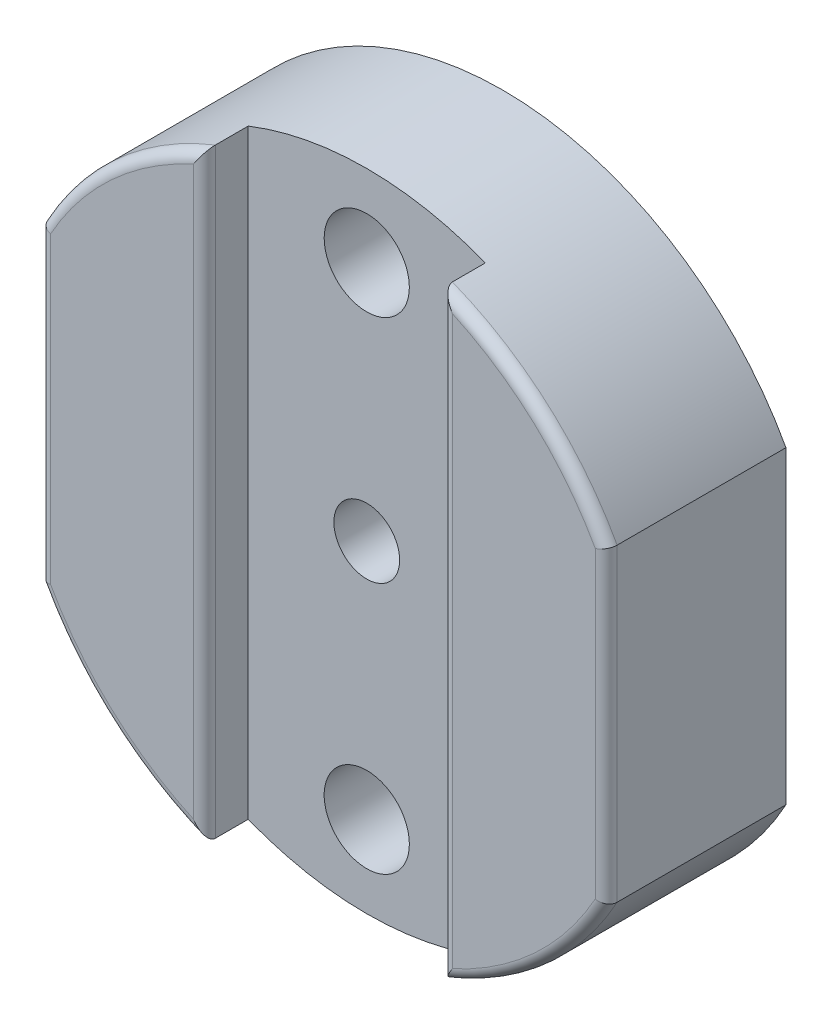
ISO-10303-21;
HEADER;
FILE_DESCRIPTION(('STEP AP214'),'2;1');
FILE_NAME('part.step','',(''),(''),'','','');
FILE_SCHEMA(('AUTOMOTIVE_DESIGN { 1 0 10303 214 1 1 1 1 }'));
ENDSEC;
DATA;
#1=APPLICATION_CONTEXT('core data for automotive mechanical design processes');
#2=APPLICATION_PROTOCOL_DEFINITION('international standard','automotive_design',2000,#1);
#3=PRODUCT_CONTEXT('',#1,'mechanical');
#4=PRODUCT('Part','Part','',(#3));
#5=PRODUCT_RELATED_PRODUCT_CATEGORY('part','',(#4));
#6=PRODUCT_DEFINITION_FORMATION('','',#4);
#7=PRODUCT_DEFINITION_CONTEXT('part definition',#1,'design');
#8=PRODUCT_DEFINITION('design','',#6,#7);
#9=PRODUCT_DEFINITION_SHAPE('','',#8);
#10=(LENGTH_UNIT() NAMED_UNIT(*) SI_UNIT(.MILLI.,.METRE.));
#11=(NAMED_UNIT(*) PLANE_ANGLE_UNIT() SI_UNIT($,.RADIAN.));
#12=(NAMED_UNIT(*) SI_UNIT($,.STERADIAN.) SOLID_ANGLE_UNIT());
#13=UNCERTAINTY_MEASURE_WITH_UNIT(LENGTH_MEASURE(1.E-05),#10,'distance_accuracy_value','');
#14=(GEOMETRIC_REPRESENTATION_CONTEXT(3) GLOBAL_UNCERTAINTY_ASSIGNED_CONTEXT((#13)) GLOBAL_UNIT_ASSIGNED_CONTEXT((#10,
#11,#12)) REPRESENTATION_CONTEXT('',''));
#15=CARTESIAN_POINT('',(0.,0.,0.));
#16=DIRECTION('',(0.,0.,1.));
#17=DIRECTION('',(1.,0.,0.));
#18=AXIS2_PLACEMENT_3D('',#15,#16,#17);
#19=CARTESIAN_POINT('',(0.,0.,0.));
#20=DIRECTION('',(0.,0.,-1.));
#21=DIRECTION('',(1.,0.,0.));
#22=AXIS2_PLACEMENT_3D('',#19,#20,#21);
#23=PLANE('',#22);
#24=CARTESIAN_POINT('',(0.,0.,0.));
#25=DIRECTION('',(0.,0.,-1.));
#26=DIRECTION('',(-1.,0.,0.));
#27=AXIS2_PLACEMENT_3D('',#24,#25,#26);
#28=CIRCLE('',#27,1.5);
#29=CARTESIAN_POINT('',(-1.5,0.,0.));
#30=VERTEX_POINT('',#29);
#31=EDGE_CURVE('E196',#30,#30,#28,.T.);
#32=ORIENTED_EDGE('',*,*,#31,.F.);
#33=EDGE_LOOP('',(#32));
#34=FACE_BOUND('',#33,.T.);
#35=CARTESIAN_POINT('',(0.,11.,0.));
#36=DIRECTION('',(0.,0.,-1.));
#37=DIRECTION('',(-1.,0.,0.));
#38=AXIS2_PLACEMENT_3D('',#35,#36,#37);
#39=CIRCLE('',#38,1.9431);
#40=CARTESIAN_POINT('',(-1.9431,11.,0.));
#41=VERTEX_POINT('',#40);
#42=EDGE_CURVE('E193',#41,#41,#39,.T.);
#43=ORIENTED_EDGE('',*,*,#42,.F.);
#44=EDGE_LOOP('',(#43));
#45=FACE_BOUND('',#44,.T.);
#46=CARTESIAN_POINT('',(0.,-11.,0.));
#47=DIRECTION('',(0.,0.,-1.));
#48=DIRECTION('',(1.,0.,0.));
#49=AXIS2_PLACEMENT_3D('',#46,#47,#48);
#50=CIRCLE('',#49,1.9431);
#51=CARTESIAN_POINT('',(1.9431,-11.,0.));
#52=VERTEX_POINT('',#51);
#53=EDGE_CURVE('E190',#52,#52,#50,.T.);
#54=ORIENTED_EDGE('',*,*,#53,.F.);
#55=EDGE_LOOP('',(#54));
#56=FACE_BOUND('',#55,.T.);
#57=DIRECTION('',(0.,1.,0.));
#58=VECTOR('',#57,1.);
#59=CARTESIAN_POINT('',(12.925,-7.0547856097829,0.));
#60=LINE('',#59,#58);
#61=CARTESIAN_POINT('',(12.925,-7.0547856097829,0.));
#62=VERTEX_POINT('',#61);
#63=CARTESIAN_POINT('',(12.925,7.05478560978291,0.));
#64=VERTEX_POINT('',#63);
#65=EDGE_CURVE('E153',#62,#64,#60,.T.);
#66=ORIENTED_EDGE('',*,*,#65,.F.);
#67=CARTESIAN_POINT('',(0.,0.,0.));
#68=DIRECTION('',(0.,0.,1.));
#69=DIRECTION('',(1.,0.,0.));
#70=AXIS2_PLACEMENT_3D('',#67,#68,#69);
#71=CIRCLE('',#70,14.725);
#72=CARTESIAN_POINT('',(-12.925,-7.0547856097829,0.));
#73=VERTEX_POINT('',#72);
#74=EDGE_CURVE('E155',#73,#62,#71,.T.);
#75=ORIENTED_EDGE('',*,*,#74,.F.);
#76=DIRECTION('',(0.,-1.,0.));
#77=VECTOR('',#76,1.);
#78=CARTESIAN_POINT('',(-12.925,7.05478560978291,0.));
#79=LINE('',#78,#77);
#80=CARTESIAN_POINT('',(-12.925,7.05478560978291,0.));
#81=VERTEX_POINT('',#80);
#82=EDGE_CURVE('E136',#81,#73,#79,.T.);
#83=ORIENTED_EDGE('',*,*,#82,.F.);
#84=CARTESIAN_POINT('',(0.,0.,0.));
#85=DIRECTION('',(0.,0.,1.));
#86=DIRECTION('',(1.,0.,0.));
#87=AXIS2_PLACEMENT_3D('',#84,#85,#86);
#88=CIRCLE('',#87,14.725);
#89=EDGE_CURVE('E147',#64,#81,#88,.T.);
#90=ORIENTED_EDGE('',*,*,#89,.F.);
#91=EDGE_LOOP('',(#66,#75,#83,#90));
#92=FACE_BOUND('',#91,.T.);
#93=ADVANCED_FACE('F32',(#34,#45,#56,#92),#23,.T.);
#94=CARTESIAN_POINT('',(0.,0.,8.2));
#95=DIRECTION('',(0.,0.,1.));
#96=DIRECTION('',(-1.,0.,0.));
#97=AXIS2_PLACEMENT_3D('',#94,#95,#96);
#98=PLANE('',#97);
#99=DIRECTION('',(0.,1.,0.));
#100=VECTOR('',#99,1.);
#101=CARTESIAN_POINT('',(-12.425,7.05478560978291,8.2));
#102=LINE('',#101,#100);
#103=CARTESIAN_POINT('',(-12.425,-6.92603782836912,8.2));
#104=VERTEX_POINT('',#103);
#105=CARTESIAN_POINT('',(-12.425,6.92603782836912,8.2));
#106=VERTEX_POINT('',#105);
#107=EDGE_CURVE('E231',#104,#106,#102,.T.);
#108=ORIENTED_EDGE('',*,*,#107,.F.);
#109=CARTESIAN_POINT('',(0.,0.,8.2));
#110=DIRECTION('',(0.,0.,-1.));
#111=DIRECTION('',(-1.,0.,0.));
#112=AXIS2_PLACEMENT_3D('',#109,#110,#111);
#113=CIRCLE('',#112,14.225);
#114=CARTESIAN_POINT('',(-5.90833333333334,-12.9399467627275,8.2));
#115=VERTEX_POINT('',#114);
#116=EDGE_CURVE('E228',#115,#104,#113,.T.);
#117=ORIENTED_EDGE('',*,*,#116,.F.);
#118=DIRECTION('',(0.,1.,0.));
#119=VECTOR('',#118,1.);
#120=CARTESIAN_POINT('',(-5.90833333333334,-13.6958225585598,8.2));
#121=LINE('',#120,#119);
#122=CARTESIAN_POINT('',(-5.90833333333334,12.9399467627275,8.2));
#123=VERTEX_POINT('',#122);
#124=EDGE_CURVE('E225',#123,#115,#121,.F.);
#125=ORIENTED_EDGE('',*,*,#124,.F.);
#126=CARTESIAN_POINT('',(0.,0.,8.2));
#127=DIRECTION('',(0.,0.,-1.));
#128=DIRECTION('',(-1.,0.,0.));
#129=AXIS2_PLACEMENT_3D('',#126,#127,#128);
#130=CIRCLE('',#129,14.225);
#131=EDGE_CURVE('E234',#106,#123,#130,.T.);
#132=ORIENTED_EDGE('',*,*,#131,.F.);
#133=EDGE_LOOP('',(#108,#117,#125,#132));
#134=FACE_BOUND('',#133,.T.);
#135=ADVANCED_FACE('F270',(#134),#98,.T.);
#136=CARTESIAN_POINT('',(0.,0.,8.2));
#137=DIRECTION('',(0.,0.,-1.));
#138=DIRECTION('',(-1.,0.,0.));
#139=AXIS2_PLACEMENT_3D('',#136,#137,#138);
#140=CIRCLE('',#139,14.225);
#141=CARTESIAN_POINT('',(5.90833333333333,12.9399467627275,8.2));
#142=VERTEX_POINT('',#141);
#143=CARTESIAN_POINT('',(12.425,6.92603782836911,8.2));
#144=VERTEX_POINT('',#143);
#145=EDGE_CURVE('E211',#142,#144,#140,.T.);
#146=ORIENTED_EDGE('',*,*,#145,.F.);
#147=DIRECTION('',(0.,-1.,0.));
#148=VECTOR('',#147,1.);
#149=CARTESIAN_POINT('',(5.90833333333333,13.6958225585598,8.2));
#150=LINE('',#149,#148);
#151=CARTESIAN_POINT('',(5.90833333333333,-12.9399467627275,8.2));
#152=VERTEX_POINT('',#151);
#153=EDGE_CURVE('E206',#152,#142,#150,.F.);
#154=ORIENTED_EDGE('',*,*,#153,.F.);
#155=CARTESIAN_POINT('',(0.,0.,8.2));
#156=DIRECTION('',(0.,0.,-1.));
#157=DIRECTION('',(-1.,0.,0.));
#158=AXIS2_PLACEMENT_3D('',#155,#156,#157);
#159=CIRCLE('',#158,14.225);
#160=CARTESIAN_POINT('',(12.425,-6.92603782836911,8.2));
#161=VERTEX_POINT('',#160);
#162=EDGE_CURVE('E209',#161,#152,#159,.T.);
#163=ORIENTED_EDGE('',*,*,#162,.F.);
#164=DIRECTION('',(0.,-1.,0.));
#165=VECTOR('',#164,1.);
#166=CARTESIAN_POINT('',(12.425,-7.0547856097829,8.2));
#167=LINE('',#166,#165);
#168=EDGE_CURVE('E214',#144,#161,#167,.T.);
#169=ORIENTED_EDGE('',*,*,#168,.F.);
#170=EDGE_LOOP('',(#146,#154,#163,#169));
#171=FACE_BOUND('',#170,.T.);
#172=ADVANCED_FACE('F274',(#171),#98,.T.);
#173=CARTESIAN_POINT('',(0.,0.,0.));
#174=DIRECTION('',(0.,0.,1.));
#175=DIRECTION('',(-1.,0.,0.));
#176=AXIS2_PLACEMENT_3D('',#173,#174,#175);
#177=CYLINDRICAL_SURFACE('',#176,1.5);
#178=CARTESIAN_POINT('',(0.,0.,6.2));
#179=DIRECTION('',(0.,0.,1.));
#180=DIRECTION('',(0.,1.,0.));
#181=AXIS2_PLACEMENT_3D('',#178,#179,#180);
#182=CIRCLE('',#181,1.5);
#183=CARTESIAN_POINT('',(0.,1.5,6.2));
#184=VERTEX_POINT('',#183);
#185=EDGE_CURVE('E183',#184,#184,#182,.T.);
#186=ORIENTED_EDGE('',*,*,#185,.T.);
#187=EDGE_LOOP('',(#186));
#188=FACE_BOUND('',#187,.T.);
#189=ORIENTED_EDGE('',*,*,#31,.T.);
#190=EDGE_LOOP('',(#189));
#191=FACE_BOUND('',#190,.T.);
#192=ADVANCED_FACE('F276',(#188,#191),#177,.F.);
#193=CARTESIAN_POINT('',(0.,11.,0.));
#194=DIRECTION('',(0.,0.,1.));
#195=DIRECTION('',(-1.,0.,0.));
#196=AXIS2_PLACEMENT_3D('',#193,#194,#195);
#197=CYLINDRICAL_SURFACE('',#196,1.9431);
#198=CARTESIAN_POINT('',(0.,11.,6.2));
#199=DIRECTION('',(0.,0.,1.));
#200=DIRECTION('',(1.,0.,0.));
#201=AXIS2_PLACEMENT_3D('',#198,#199,#200);
#202=CIRCLE('',#201,1.9431);
#203=CARTESIAN_POINT('',(1.9431,11.,6.2));
#204=VERTEX_POINT('',#203);
#205=EDGE_CURVE('E187',#204,#204,#202,.F.);
#206=ORIENTED_EDGE('',*,*,#205,.F.);
#207=EDGE_LOOP('',(#206));
#208=FACE_BOUND('',#207,.T.);
#209=ORIENTED_EDGE('',*,*,#42,.T.);
#210=EDGE_LOOP('',(#209));
#211=FACE_BOUND('',#210,.T.);
#212=ADVANCED_FACE('F279',(#208,#211),#197,.F.);
#213=CARTESIAN_POINT('',(0.,-11.,0.));
#214=DIRECTION('',(0.,0.,1.));
#215=DIRECTION('',(-1.,0.,0.));
#216=AXIS2_PLACEMENT_3D('',#213,#214,#215);
#217=CYLINDRICAL_SURFACE('',#216,1.9431);
#218=CARTESIAN_POINT('',(0.,-11.,6.2));
#219=DIRECTION('',(0.,0.,1.));
#220=DIRECTION('',(1.,0.,0.));
#221=AXIS2_PLACEMENT_3D('',#218,#219,#220);
#222=CIRCLE('',#221,1.9431);
#223=CARTESIAN_POINT('',(1.9431,-11.,6.2));
#224=VERTEX_POINT('',#223);
#225=EDGE_CURVE('E186',#224,#224,#222,.F.);
#226=ORIENTED_EDGE('',*,*,#225,.F.);
#227=EDGE_LOOP('',(#226));
#228=FACE_BOUND('',#227,.T.);
#229=ORIENTED_EDGE('',*,*,#53,.T.);
#230=EDGE_LOOP('',(#229));
#231=FACE_BOUND('',#230,.T.);
#232=ADVANCED_FACE('F283',(#228,#231),#217,.F.);
#233=CARTESIAN_POINT('',(0.,0.,6.2));
#234=DIRECTION('',(0.,0.,-1.));
#235=DIRECTION('',(0.,1.,0.));
#236=AXIS2_PLACEMENT_3D('',#233,#234,#235);
#237=PLANE('',#236);
#238=ORIENTED_EDGE('',*,*,#205,.T.);
#239=EDGE_LOOP('',(#238));
#240=FACE_BOUND('',#239,.T.);
#241=ORIENTED_EDGE('',*,*,#185,.F.);
#242=EDGE_LOOP('',(#241));
#243=FACE_BOUND('',#242,.T.);
#244=ORIENTED_EDGE('',*,*,#225,.T.);
#245=EDGE_LOOP('',(#244));
#246=FACE_BOUND('',#245,.T.);
#247=CARTESIAN_POINT('',(0.,0.,6.2));
#248=DIRECTION('',(0.,0.,1.));
#249=DIRECTION('',(1.,0.,0.));
#250=AXIS2_PLACEMENT_3D('',#247,#248,#249);
#251=CIRCLE('',#250,14.725);
#252=CARTESIAN_POINT('',(5.40833333333333,-13.6958225585598,6.2));
#253=VERTEX_POINT('',#252);
#254=CARTESIAN_POINT('',(-5.40833333333334,-13.6958225585598,6.2));
#255=VERTEX_POINT('',#254);
#256=EDGE_CURVE('E177',#253,#255,#251,.F.);
#257=ORIENTED_EDGE('',*,*,#256,.F.);
#258=DIRECTION('',(0.,-1.,0.));
#259=VECTOR('',#258,1.);
#260=CARTESIAN_POINT('',(5.40833333333333,13.7765352282256,6.2));
#261=LINE('',#260,#259);
#262=CARTESIAN_POINT('',(5.40833333333333,13.6958225585598,6.2));
#263=VERTEX_POINT('',#262);
#264=EDGE_CURVE('E162',#263,#253,#261,.T.);
#265=ORIENTED_EDGE('',*,*,#264,.F.);
#266=CARTESIAN_POINT('',(0.,0.,6.2));
#267=DIRECTION('',(0.,0.,1.));
#268=DIRECTION('',(1.,0.,0.));
#269=AXIS2_PLACEMENT_3D('',#266,#267,#268);
#270=CIRCLE('',#269,14.725);
#271=CARTESIAN_POINT('',(-5.40833333333334,13.6958225585598,6.2));
#272=VERTEX_POINT('',#271);
#273=EDGE_CURVE('E180',#272,#263,#270,.F.);
#274=ORIENTED_EDGE('',*,*,#273,.F.);
#275=DIRECTION('',(0.,1.,0.));
#276=VECTOR('',#275,1.);
#277=CARTESIAN_POINT('',(-5.40833333333334,-13.7765352282256,6.2));
#278=LINE('',#277,#276);
#279=EDGE_CURVE('E166',#255,#272,#278,.T.);
#280=ORIENTED_EDGE('',*,*,#279,.F.);
#281=EDGE_LOOP('',(#257,#265,#274,#280));
#282=FACE_BOUND('',#281,.T.);
#283=ADVANCED_FACE('F287',(#240,#243,#246,#282),#237,.F.);
#284=CARTESIAN_POINT('',(12.925,7.05478560978291,47.59746184718));
#285=DIRECTION('',(-1.,0.,0.));
#286=DIRECTION('',(0.,0.,-1.));
#287=AXIS2_PLACEMENT_3D('',#284,#285,#286);
#288=PLANE('',#287);
#289=DIRECTION('',(0.,0.,-1.));
#290=VECTOR('',#289,1.);
#291=CARTESIAN_POINT('',(12.925,-7.0547856097829,47.59746184718));
#292=LINE('',#291,#290);
#293=CARTESIAN_POINT('',(12.925,-7.0547856097829,7.7));
#294=VERTEX_POINT('',#293);
#295=EDGE_CURVE('E54',#294,#62,#292,.T.);
#296=ORIENTED_EDGE('',*,*,#295,.T.);
#297=ORIENTED_EDGE('',*,*,#65,.T.);
#298=DIRECTION('',(0.,0.,-1.));
#299=VECTOR('',#298,1.);
#300=CARTESIAN_POINT('',(12.925,7.05478560978291,47.59746184718));
#301=LINE('',#300,#299);
#302=CARTESIAN_POINT('',(12.925,7.05478560978291,7.7));
#303=VERTEX_POINT('',#302);
#304=EDGE_CURVE('E144',#303,#64,#301,.T.);
#305=ORIENTED_EDGE('',*,*,#304,.F.);
#306=DIRECTION('',(0.,-1.,0.));
#307=VECTOR('',#306,1.);
#308=CARTESIAN_POINT('',(12.925,7.05478560978291,7.7));
#309=LINE('',#308,#307);
#310=EDGE_CURVE('E217',#294,#303,#309,.F.);
#311=ORIENTED_EDGE('',*,*,#310,.F.);
#312=EDGE_LOOP('',(#296,#297,#305,#311));
#313=FACE_BOUND('',#312,.T.);
#314=ADVANCED_FACE('F291',(#313),#288,.F.);
#315=CARTESIAN_POINT('',(0.,0.,47.59746184718));
#316=DIRECTION('',(0.,0.,-1.));
#317=DIRECTION('',(1.,0.,0.));
#318=AXIS2_PLACEMENT_3D('',#315,#316,#317);
#319=CYLINDRICAL_SURFACE('',#318,14.725);
#320=ORIENTED_EDGE('',*,*,#304,.T.);
#321=ORIENTED_EDGE('',*,*,#89,.T.);
#322=DIRECTION('',(0.,0.,-1.));
#323=VECTOR('',#322,1.);
#324=CARTESIAN_POINT('',(-12.925,7.05478560978291,47.59746184718));
#325=LINE('',#324,#323);
#326=CARTESIAN_POINT('',(-12.925,7.05478560978291,7.7));
#327=VERTEX_POINT('',#326);
#328=EDGE_CURVE('E131',#327,#81,#325,.T.);
#329=ORIENTED_EDGE('',*,*,#328,.F.);
#330=CARTESIAN_POINT('',(0.,0.,7.7));
#331=DIRECTION('',(0.,0.,-1.));
#332=DIRECTION('',(-1.,0.,0.));
#333=AXIS2_PLACEMENT_3D('',#330,#331,#332);
#334=CIRCLE('',#333,14.725);
#335=CARTESIAN_POINT('',(-5.40833333333334,13.6958225585598,7.7));
#336=VERTEX_POINT('',#335);
#337=EDGE_CURVE('E220',#336,#327,#334,.F.);
#338=ORIENTED_EDGE('',*,*,#337,.F.);
#339=DIRECTION('',(0.,0.,-1.));
#340=VECTOR('',#339,1.);
#341=CARTESIAN_POINT('',(-5.40833333333334,13.6958225585598,47.59746184718));
#342=LINE('',#341,#340);
#343=EDGE_CURVE('E171',#272,#336,#342,.F.);
#344=ORIENTED_EDGE('',*,*,#343,.F.);
#345=ORIENTED_EDGE('',*,*,#273,.T.);
#346=DIRECTION('',(0.,0.,-1.));
#347=VECTOR('',#346,1.);
#348=CARTESIAN_POINT('',(5.40833333333333,13.6958225585598,47.59746184718));
#349=LINE('',#348,#347);
#350=CARTESIAN_POINT('',(5.40833333333333,13.6958225585598,7.7));
#351=VERTEX_POINT('',#350);
#352=EDGE_CURVE('E165',#351,#263,#349,.T.);
#353=ORIENTED_EDGE('',*,*,#352,.F.);
#354=CARTESIAN_POINT('',(0.,0.,7.7));
#355=DIRECTION('',(0.,0.,-1.));
#356=DIRECTION('',(-1.,0.,0.));
#357=AXIS2_PLACEMENT_3D('',#354,#355,#356);
#358=CIRCLE('',#357,14.725);
#359=EDGE_CURVE('E222',#303,#351,#358,.F.);
#360=ORIENTED_EDGE('',*,*,#359,.F.);
#361=EDGE_LOOP('',(#320,#321,#329,#338,#344,#345,#353,#360));
#362=FACE_BOUND('',#361,.T.);
#363=ADVANCED_FACE('F148',(#362),#319,.T.);
#364=CARTESIAN_POINT('',(-12.925,-7.05478560978291,47.59746184718));
#365=DIRECTION('',(1.,0.,0.));
#366=DIRECTION('',(0.,0.,1.));
#367=AXIS2_PLACEMENT_3D('',#364,#365,#366);
#368=PLANE('',#367);
#369=ORIENTED_EDGE('',*,*,#328,.T.);
#370=ORIENTED_EDGE('',*,*,#82,.T.);
#371=DIRECTION('',(0.,0.,-1.));
#372=VECTOR('',#371,1.);
#373=CARTESIAN_POINT('',(-12.925,-7.05478560978291,47.59746184718));
#374=LINE('',#373,#372);
#375=CARTESIAN_POINT('',(-12.925,-7.05478560978291,7.7));
#376=VERTEX_POINT('',#375);
#377=EDGE_CURVE('E143',#376,#73,#374,.T.);
#378=ORIENTED_EDGE('',*,*,#377,.F.);
#379=DIRECTION('',(0.,1.,0.));
#380=VECTOR('',#379,1.);
#381=CARTESIAN_POINT('',(-12.925,-7.05478560978291,7.7));
#382=LINE('',#381,#380);
#383=EDGE_CURVE('E139',#327,#376,#382,.F.);
#384=ORIENTED_EDGE('',*,*,#383,.F.);
#385=EDGE_LOOP('',(#369,#370,#378,#384));
#386=FACE_BOUND('',#385,.T.);
#387=ADVANCED_FACE('F133',(#386),#368,.F.);
#388=CARTESIAN_POINT('',(0.,0.,47.59746184718));
#389=DIRECTION('',(0.,0.,-1.));
#390=DIRECTION('',(1.,0.,0.));
#391=AXIS2_PLACEMENT_3D('',#388,#389,#390);
#392=CYLINDRICAL_SURFACE('',#391,14.725);
#393=ORIENTED_EDGE('',*,*,#377,.T.);
#394=ORIENTED_EDGE('',*,*,#74,.T.);
#395=ORIENTED_EDGE('',*,*,#295,.F.);
#396=CARTESIAN_POINT('',(0.,0.,7.7));
#397=DIRECTION('',(0.,0.,-1.));
#398=DIRECTION('',(-1.,0.,0.));
#399=AXIS2_PLACEMENT_3D('',#396,#397,#398);
#400=CIRCLE('',#399,14.725);
#401=CARTESIAN_POINT('',(5.40833333333333,-13.6958225585598,7.7));
#402=VERTEX_POINT('',#401);
#403=EDGE_CURVE('E238',#402,#294,#400,.F.);
#404=ORIENTED_EDGE('',*,*,#403,.F.);
#405=DIRECTION('',(0.,0.,-1.));
#406=VECTOR('',#405,1.);
#407=CARTESIAN_POINT('',(5.40833333333333,-13.6958225585598,47.59746184718));
#408=LINE('',#407,#406);
#409=EDGE_CURVE('E199',#253,#402,#408,.F.);
#410=ORIENTED_EDGE('',*,*,#409,.F.);
#411=ORIENTED_EDGE('',*,*,#256,.T.);
#412=DIRECTION('',(0.,0.,-1.));
#413=VECTOR('',#412,1.);
#414=CARTESIAN_POINT('',(-5.40833333333334,-13.6958225585598,47.59746184718));
#415=LINE('',#414,#413);
#416=CARTESIAN_POINT('',(-5.40833333333334,-13.6958225585598,7.7));
#417=VERTEX_POINT('',#416);
#418=EDGE_CURVE('E204',#417,#255,#415,.T.);
#419=ORIENTED_EDGE('',*,*,#418,.F.);
#420=CARTESIAN_POINT('',(0.,0.,7.7));
#421=DIRECTION('',(0.,0.,-1.));
#422=DIRECTION('',(-1.,0.,0.));
#423=AXIS2_PLACEMENT_3D('',#420,#421,#422);
#424=CIRCLE('',#423,14.725);
#425=EDGE_CURVE('E240',#376,#417,#424,.F.);
#426=ORIENTED_EDGE('',*,*,#425,.F.);
#427=EDGE_LOOP('',(#393,#394,#395,#404,#410,#411,#419,#426));
#428=FACE_BOUND('',#427,.T.);
#429=ADVANCED_FACE('F293',(#428),#392,.T.);
#430=CARTESIAN_POINT('',(5.40833333333333,13.7765352282256,-25.3042407278005));
#431=DIRECTION('',(1.,0.,0.));
#432=DIRECTION('',(0.,-1.,0.));
#433=AXIS2_PLACEMENT_3D('',#430,#431,#432);
#434=PLANE('',#433);
#435=ORIENTED_EDGE('',*,*,#352,.T.);
#436=ORIENTED_EDGE('',*,*,#264,.T.);
#437=ORIENTED_EDGE('',*,*,#409,.T.);
#438=DIRECTION('',(0.,-1.,0.));
#439=VECTOR('',#438,1.);
#440=CARTESIAN_POINT('',(5.40833333333333,-13.6958225585598,7.7));
#441=LINE('',#440,#439);
#442=EDGE_CURVE('E11',#351,#402,#441,.T.);
#443=ORIENTED_EDGE('',*,*,#442,.F.);
#444=EDGE_LOOP('',(#435,#436,#437,#443));
#445=FACE_BOUND('',#444,.T.);
#446=ADVANCED_FACE('F296',(#445),#434,.F.);
#447=CARTESIAN_POINT('',(-5.40833333333334,-13.7765352282256,-25.3042407278005));
#448=DIRECTION('',(-1.,0.,0.));
#449=DIRECTION('',(0.,0.,-1.));
#450=AXIS2_PLACEMENT_3D('',#447,#448,#449);
#451=PLANE('',#450);
#452=ORIENTED_EDGE('',*,*,#418,.T.);
#453=ORIENTED_EDGE('',*,*,#279,.T.);
#454=ORIENTED_EDGE('',*,*,#343,.T.);
#455=DIRECTION('',(0.,1.,0.));
#456=VECTOR('',#455,1.);
#457=CARTESIAN_POINT('',(-5.40833333333334,13.6958225585598,7.7));
#458=LINE('',#457,#456);
#459=EDGE_CURVE('E46',#417,#336,#458,.T.);
#460=ORIENTED_EDGE('',*,*,#459,.F.);
#461=EDGE_LOOP('',(#452,#453,#454,#460));
#462=FACE_BOUND('',#461,.T.);
#463=ADVANCED_FACE('F304',(#462),#451,.F.);
#464=CARTESIAN_POINT('',(5.90833333333333,13.7765352282256,7.7));
#465=DIRECTION('',(0.,1.,0.));
#466=DIRECTION('',(1.,0.,0.));
#467=AXIS2_PLACEMENT_3D('',#464,#465,#466);
#468=CYLINDRICAL_SURFACE('',#467,0.5);
#469=CARTESIAN_POINT('',(5.40833333333333,-13.6958225585598,7.7));
#470=CARTESIAN_POINT('',(5.40829384711575,-13.695879598566,7.719941830468));
#471=CARTESIAN_POINT('',(5.40952369239341,-13.6940727602276,7.73978940148304));
#472=CARTESIAN_POINT('',(5.4141518687906,-13.6872670984627,7.7784012695857));
#473=CARTESIAN_POINT('',(5.41752057898569,-13.6823118760416,7.79717660397759));
#474=CARTESIAN_POINT('',(5.42605070028256,-13.6697539347741,7.83322593198004));
#475=CARTESIAN_POINT('',(5.43120232346651,-13.6621656703427,7.8505074918031));
#476=CARTESIAN_POINT('',(5.44290701942942,-13.6449061619235,7.88353695736588));
#477=CARTESIAN_POINT('',(5.44946518556391,-13.6352273467318,7.89927897817633));
#478=CARTESIAN_POINT('',(5.46780994992915,-13.6081190393502,7.9379756218761));
#479=CARTESIAN_POINT('',(5.48039758049777,-13.5894870787892,7.95970205919639));
#480=CARTESIAN_POINT('',(5.50721969135807,-13.5496912465308,7.99947331858316));
#481=CARTESIAN_POINT('',(5.52145785607351,-13.5285217065654,8.01750964541701));
#482=CARTESIAN_POINT('',(5.56128397375436,-13.4691546405264,8.06189994921482));
#483=CARTESIAN_POINT('',(5.58785259761357,-13.4293922076742,8.08526320085064));
#484=CARTESIAN_POINT('',(5.64239695399889,-13.3473703668457,8.12474602810753));
#485=CARTESIAN_POINT('',(5.67037582777217,-13.3051053443137,8.14084855946047));
#486=CARTESIAN_POINT('',(5.73277862982028,-13.2103709129947,8.16967257126196));
#487=CARTESIAN_POINT('',(5.76734785958036,-13.1575859662553,8.18102398407752));
#488=CARTESIAN_POINT('',(5.83660347142049,-13.0511828706045,8.19609023690708));
#489=CARTESIAN_POINT('',(5.87128952136998,-12.9975664315286,8.1998190752563));
#490=CARTESIAN_POINT('',(5.90664314051842,-12.9425763434006,8.19999784560914));
#491=CARTESIAN_POINT('',(5.9074882921977,-12.9412615677605,8.1999999872699));
#492=CARTESIAN_POINT('',(5.90833333333333,-12.9399467627275,8.2));
#493=B_SPLINE_CURVE_WITH_KNOTS('',3,(#469,#470,#471,#472,#473,#474,#475,#476,#477,#478,#479,
#480,#481,#482,#483,#484,#485,#486,#487,#488,#489,#490,#491,#492),.UNSPECIFIED.,.F.,.F.,(4,2,2,
2,2,2,2,2,2,2,2,4),(0.,0.0595569344149248,0.118306544031723,0.176738613426599,0.235385960805569,
0.328654967272641,0.422136336140694,0.580917982757283,0.7400704472067,0.931853045733306,
1.12328313112064,1.1279720778607),.UNSPECIFIED.);
#494=EDGE_CURVE('E62',#402,#152,#493,.T.);
#495=ORIENTED_EDGE('',*,*,#494,.T.);
#496=ORIENTED_EDGE('',*,*,#153,.T.);
#497=CARTESIAN_POINT('',(5.40833333333333,13.6958225585598,7.7));
#498=CARTESIAN_POINT('',(5.40829384711576,13.695879598566,7.719941830468));
#499=CARTESIAN_POINT('',(5.40952369239341,13.6940727602276,7.73978940148304));
#500=CARTESIAN_POINT('',(5.4141518687906,13.6872670984627,7.7784012695857));
#501=CARTESIAN_POINT('',(5.41752057898569,13.6823118760416,7.79717660397759));
#502=CARTESIAN_POINT('',(5.42605070028256,13.6697539347741,7.83322593198004));
#503=CARTESIAN_POINT('',(5.43120232346651,13.6621656703427,7.8505074918031));
#504=CARTESIAN_POINT('',(5.44290701942943,13.6449061619235,7.88353695736588));
#505=CARTESIAN_POINT('',(5.44946518556391,13.6352273467318,7.89927897817633));
#506=CARTESIAN_POINT('',(5.46780994992915,13.6081190393502,7.9379756218761));
#507=CARTESIAN_POINT('',(5.48039758049777,13.5894870787892,7.95970205919639));
#508=CARTESIAN_POINT('',(5.50721969135808,13.5496912465308,7.99947331858316));
#509=CARTESIAN_POINT('',(5.52145785607351,13.5285217065654,8.01750964541701));
#510=CARTESIAN_POINT('',(5.56128397375436,13.4691546405264,8.06189994921482));
#511=CARTESIAN_POINT('',(5.58785259761357,13.4293922076742,8.08526320085064));
#512=CARTESIAN_POINT('',(5.6423969539989,13.3473703668457,8.12474602810753));
#513=CARTESIAN_POINT('',(5.67037582777217,13.3051053443137,8.14084855946047));
#514=CARTESIAN_POINT('',(5.73277862982028,13.2103709129947,8.16967257126196));
#515=CARTESIAN_POINT('',(5.76734785958036,13.1575859662553,8.18102398407752));
#516=CARTESIAN_POINT('',(5.8366034714205,13.0511828706045,8.19609023690708));
#517=CARTESIAN_POINT('',(5.87128952137001,12.9975664315286,8.1998190752563));
#518=CARTESIAN_POINT('',(5.90664314051842,12.9425763434006,8.19999784560914));
#519=CARTESIAN_POINT('',(5.9074882921977,12.9412615677605,8.1999999872699));
#520=CARTESIAN_POINT('',(5.90833333333333,12.9399467627275,8.2));
#521=B_SPLINE_CURVE_WITH_KNOTS('',3,(#497,#498,#499,#500,#501,#502,#503,#504,#505,#506,#507,
#508,#509,#510,#511,#512,#513,#514,#515,#516,#517,#518,#519,#520),.UNSPECIFIED.,.F.,.F.,(4,2,2,
2,2,2,2,2,2,2,2,4),(0.,0.0595569344149248,0.118306544031722,0.176738613426599,0.235385960805567,
0.328654967272641,0.422136336140694,0.580917982757281,0.740070447206701,0.931853045733306,
1.12328313112064,1.1279720778607),.UNSPECIFIED.);
#522=EDGE_CURVE('E169',#142,#351,#521,.F.);
#523=ORIENTED_EDGE('',*,*,#522,.T.);
#524=ORIENTED_EDGE('',*,*,#442,.T.);
#525=EDGE_LOOP('',(#495,#496,#523,#524));
#526=FACE_BOUND('',#525,.T.);
#527=ADVANCED_FACE('F307',(#526),#468,.T.);
#528=CARTESIAN_POINT('',(0.,0.,7.7));
#529=DIRECTION('',(0.,0.,1.));
#530=DIRECTION('',(-1.,0.,0.));
#531=AXIS2_PLACEMENT_3D('',#528,#529,#530);
#532=TOROIDAL_SURFACE('',#531,14.225,0.5);
#533=ORIENTED_EDGE('',*,*,#522,.F.);
#534=ORIENTED_EDGE('',*,*,#145,.T.);
#535=CARTESIAN_POINT('',(12.925,7.05478560978291,7.7));
#536=CARTESIAN_POINT('',(12.9250266323857,7.05479212371006,7.72749455468149));
#537=CARTESIAN_POINT('',(12.9227338797823,7.05420741475499,7.7549769169648));
#538=CARTESIAN_POINT('',(12.9137117403836,7.051905035872,7.80911166730306));
#539=CARTESIAN_POINT('',(12.9069893970008,7.05018916458298,7.83576530275926));
#540=CARTESIAN_POINT('',(12.8893074890651,7.04567326307848,7.88753363655224));
#541=CARTESIAN_POINT('',(12.8783471767862,7.04287304154559,7.91264806241229));
#542=CARTESIAN_POINT('',(12.8525527536699,7.03627748327187,7.96065449676721));
#543=CARTESIAN_POINT('',(12.8377185854038,7.0324821317785,7.983546472308));
#544=CARTESIAN_POINT('',(12.8044129996094,7.02395224587444,8.0268039876973));
#545=CARTESIAN_POINT('',(12.785896231308,7.01920599525172,8.04713226339118));
#546=CARTESIAN_POINT('',(12.7459022962359,7.0089424712527,8.08440773414089));
#547=CARTESIAN_POINT('',(12.7244241035228,7.00342493066499,8.10135375246148));
#548=CARTESIAN_POINT('',(12.6784478260235,6.99159839623789,8.1319128863403));
#549=CARTESIAN_POINT('',(12.6538791601634,6.98527080681206,8.14541247425757));
#550=CARTESIAN_POINT('',(12.6029485976585,6.97213439101674,8.168092411324));
#551=CARTESIAN_POINT('',(12.5765873360122,6.96532573502439,8.17727428092702));
#552=CARTESIAN_POINT('',(12.530313819227,6.95335566721117,8.18919402943552));
#553=CARTESIAN_POINT('',(12.5106532927152,6.94826441011486,8.19301489810037));
#554=CARTESIAN_POINT('',(12.4710610425511,6.93800014210565,8.1982728186992));
#555=CARTESIAN_POINT('',(12.4511298513832,6.9328272891742,8.19971401442419));
#556=CARTESIAN_POINT('',(12.4291352993358,6.92711248439711,8.19998720375143));
#557=CARTESIAN_POINT('',(12.4270675381202,6.92657515892462,8.20000003349121));
#558=CARTESIAN_POINT('',(12.425,6.92603782836911,8.2));
#559=B_SPLINE_CURVE_WITH_KNOTS('',3,(#535,#536,#537,#538,#539,#540,#541,#542,#543,#544,#545,
#546,#547,#548,#549,#550,#551,#552,#553,#554,#555,#556,#557,#558),.UNSPECIFIED.,.F.,.F.,(4,2,2,
2,2,2,2,2,2,2,2,4),(0.,0.0823636118122214,0.164596573741562,0.246844051064696,0.32909274775221,
0.412425196138169,0.495786586717777,0.581615979981275,0.667415126357681,0.729286551030306,
0.791050123201682,0.797459363185674),.UNSPECIFIED.);
#560=EDGE_CURVE('E253',#144,#303,#559,.F.);
#561=ORIENTED_EDGE('',*,*,#560,.T.);
#562=ORIENTED_EDGE('',*,*,#359,.T.);
#563=EDGE_LOOP('',(#533,#534,#561,#562));
#564=FACE_BOUND('',#563,.T.);
#565=ADVANCED_FACE('F342',(#564),#532,.T.);
#566=CARTESIAN_POINT('',(0.,0.,7.7));
#567=DIRECTION('',(0.,0.,1.));
#568=DIRECTION('',(-1.,0.,0.));
#569=AXIS2_PLACEMENT_3D('',#566,#567,#568);
#570=TOROIDAL_SURFACE('',#569,14.225,0.5);
#571=ORIENTED_EDGE('',*,*,#494,.F.);
#572=ORIENTED_EDGE('',*,*,#403,.T.);
#573=CARTESIAN_POINT('',(12.925,-7.0547856097829,7.7));
#574=CARTESIAN_POINT('',(12.9250266323857,-7.05479212371006,7.72749455468149));
#575=CARTESIAN_POINT('',(12.9227338797823,-7.054207414755,7.7549769169648));
#576=CARTESIAN_POINT('',(12.9137117403836,-7.05190503587201,7.80911166730306));
#577=CARTESIAN_POINT('',(12.9069893970008,-7.05018916458298,7.83576530275926));
#578=CARTESIAN_POINT('',(12.8893074890651,-7.04567326307848,7.88753363655224));
#579=CARTESIAN_POINT('',(12.8783471767862,-7.04287304154559,7.91264806241229));
#580=CARTESIAN_POINT('',(12.8525527536699,-7.03627748327187,7.96065449676721));
#581=CARTESIAN_POINT('',(12.8377185854038,-7.0324821317785,7.983546472308));
#582=CARTESIAN_POINT('',(12.8044129996094,-7.02395224587444,8.0268039876973));
#583=CARTESIAN_POINT('',(12.785896231308,-7.01920599525172,8.04713226339118));
#584=CARTESIAN_POINT('',(12.7459022962359,-7.0089424712527,8.08440773414089));
#585=CARTESIAN_POINT('',(12.7244241035228,-7.003424930665,8.10135375246148));
#586=CARTESIAN_POINT('',(12.6784478260235,-6.99159839623789,8.1319128863403));
#587=CARTESIAN_POINT('',(12.6538791601634,-6.98527080681206,8.14541247425757));
#588=CARTESIAN_POINT('',(12.6029485976585,-6.97213439101674,8.168092411324));
#589=CARTESIAN_POINT('',(12.5765873360122,-6.96532573502439,8.17727428092702));
#590=CARTESIAN_POINT('',(12.530313819227,-6.95335566721117,8.18919402943552));
#591=CARTESIAN_POINT('',(12.5106532927152,-6.94826441011485,8.19301489810037));
#592=CARTESIAN_POINT('',(12.4710610425511,-6.93800014210566,8.1982728186992));
#593=CARTESIAN_POINT('',(12.4511298513832,-6.93282728917425,8.19971401442419));
#594=CARTESIAN_POINT('',(12.4291352993358,-6.92711248439711,8.19998720375143));
#595=CARTESIAN_POINT('',(12.4270675381202,-6.92657515892463,8.20000003349121));
#596=CARTESIAN_POINT('',(12.425,-6.92603782836911,8.2));
#597=B_SPLINE_CURVE_WITH_KNOTS('',3,(#573,#574,#575,#576,#577,#578,#579,#580,#581,#582,#583,
#584,#585,#586,#587,#588,#589,#590,#591,#592,#593,#594,#595,#596),.UNSPECIFIED.,.F.,.F.,(4,2,2,
2,2,2,2,2,2,2,2,4),(0.,0.0823636118122213,0.164596573741562,0.246844051064696,0.32909274775221,
0.412425196138169,0.495786586717777,0.581615979981275,0.667415126357681,0.729286551030308,
0.791050123201684,0.797459363185674),.UNSPECIFIED.);
#598=EDGE_CURVE('E245',#294,#161,#597,.T.);
#599=ORIENTED_EDGE('',*,*,#598,.T.);
#600=ORIENTED_EDGE('',*,*,#162,.T.);
#601=EDGE_LOOP('',(#571,#572,#599,#600));
#602=FACE_BOUND('',#601,.T.);
#603=ADVANCED_FACE('F260',(#602),#570,.T.);
#604=CARTESIAN_POINT('',(12.425,0.,7.7));
#605=DIRECTION('',(0.,1.,0.));
#606=DIRECTION('',(0.,0.,1.));
#607=AXIS2_PLACEMENT_3D('',#604,#605,#606);
#608=CYLINDRICAL_SURFACE('',#607,0.5);
#609=ORIENTED_EDGE('',*,*,#560,.F.);
#610=ORIENTED_EDGE('',*,*,#168,.T.);
#611=ORIENTED_EDGE('',*,*,#598,.F.);
#612=ORIENTED_EDGE('',*,*,#310,.T.);
#613=EDGE_LOOP('',(#609,#610,#611,#612));
#614=FACE_BOUND('',#613,.T.);
#615=ADVANCED_FACE('F262',(#614),#608,.T.);
#616=CARTESIAN_POINT('',(0.,0.,7.7));
#617=DIRECTION('',(0.,0.,1.));
#618=DIRECTION('',(-1.,0.,0.));
#619=AXIS2_PLACEMENT_3D('',#616,#617,#618);
#620=TOROIDAL_SURFACE('',#619,14.225,0.5);
#621=CARTESIAN_POINT('',(-5.40833333333334,-13.6958225585598,7.7));
#622=CARTESIAN_POINT('',(-5.40829384711576,-13.695879598566,7.719941830468));
#623=CARTESIAN_POINT('',(-5.40952369239342,-13.6940727602276,7.73978940148304));
#624=CARTESIAN_POINT('',(-5.41415186879061,-13.6872670984627,7.7784012695857));
#625=CARTESIAN_POINT('',(-5.41752057898569,-13.6823118760416,7.79717660397759));
#626=CARTESIAN_POINT('',(-5.42605070028257,-13.6697539347741,7.83322593198004));
#627=CARTESIAN_POINT('',(-5.43120232346651,-13.6621656703427,7.8505074918031));
#628=CARTESIAN_POINT('',(-5.44290701942943,-13.6449061619235,7.88353695736588));
#629=CARTESIAN_POINT('',(-5.44946518556391,-13.6352273467318,7.89927897817633));
#630=CARTESIAN_POINT('',(-5.46780994992916,-13.6081190393502,7.9379756218761));
#631=CARTESIAN_POINT('',(-5.48039758049777,-13.5894870787892,7.95970205919639));
#632=CARTESIAN_POINT('',(-5.50721969135808,-13.5496912465308,7.99947331858316));
#633=CARTESIAN_POINT('',(-5.52145785607352,-13.5285217065654,8.01750964541702));
#634=CARTESIAN_POINT('',(-5.56128397375437,-13.4691546405264,8.06189994921482));
#635=CARTESIAN_POINT('',(-5.58785259761358,-13.4293922076742,8.08526320085065));
#636=CARTESIAN_POINT('',(-5.64239695399891,-13.3473703668457,8.12474602810753));
#637=CARTESIAN_POINT('',(-5.67037582777218,-13.3051053443137,8.14084855946047));
#638=CARTESIAN_POINT('',(-5.73277862982029,-13.2103709129947,8.16967257126196));
#639=CARTESIAN_POINT('',(-5.76734785958037,-13.1575859662553,8.18102398407752));
#640=CARTESIAN_POINT('',(-5.83660347142051,-13.0511828706045,8.19609023690708));
#641=CARTESIAN_POINT('',(-5.87128952137001,-12.9975664315286,8.1998190752563));
#642=CARTESIAN_POINT('',(-5.90664314051843,-12.9425763434006,8.19999784560914));
#643=CARTESIAN_POINT('',(-5.90748829219771,-12.9412615677605,8.1999999872699));
#644=CARTESIAN_POINT('',(-5.90833333333334,-12.9399467627275,8.2));
#645=B_SPLINE_CURVE_WITH_KNOTS('',3,(#621,#622,#623,#624,#625,#626,#627,#628,#629,#630,#631,
#632,#633,#634,#635,#636,#637,#638,#639,#640,#641,#642,#643,#644),.UNSPECIFIED.,.F.,.F.,(4,2,2,
2,2,2,2,2,2,2,2,4),(0.,0.0595569344149239,0.118306544031723,0.176738613426598,0.235385960805569,
0.328654967272645,0.422136336140699,0.580917982757292,0.740070447206714,0.931853045733312,
1.12328313112064,1.1279720778607),.UNSPECIFIED.);
#646=EDGE_CURVE('E362',#417,#115,#645,.T.);
#647=ORIENTED_EDGE('',*,*,#646,.T.);
#648=ORIENTED_EDGE('',*,*,#116,.T.);
#649=CARTESIAN_POINT('',(-12.925,-7.05478560978291,7.7));
#650=CARTESIAN_POINT('',(-12.9250266323857,-7.05479212371007,7.72749455468149));
#651=CARTESIAN_POINT('',(-12.9227338797823,-7.054207414755,7.7549769169648));
#652=CARTESIAN_POINT('',(-12.9137117403835,-7.05190503587201,7.80911166730306));
#653=CARTESIAN_POINT('',(-12.9069893970008,-7.05018916458298,7.83576530275926));
#654=CARTESIAN_POINT('',(-12.8893074890651,-7.04567326307848,7.88753363655224));
#655=CARTESIAN_POINT('',(-12.8783471767862,-7.0428730415456,7.91264806241229));
#656=CARTESIAN_POINT('',(-12.8525527536699,-7.03627748327188,7.96065449676721));
#657=CARTESIAN_POINT('',(-12.8377185854038,-7.03248213177851,7.983546472308));
#658=CARTESIAN_POINT('',(-12.8044129996094,-7.02395224587445,8.0268039876973));
#659=CARTESIAN_POINT('',(-12.7858962313079,-7.01920599525173,8.04713226339118));
#660=CARTESIAN_POINT('',(-12.7459022962359,-7.0089424712527,8.08440773414089));
#661=CARTESIAN_POINT('',(-12.7244241035228,-7.003424930665,8.10135375246148));
#662=CARTESIAN_POINT('',(-12.6784478260235,-6.99159839623789,8.1319128863403));
#663=CARTESIAN_POINT('',(-12.6538791601634,-6.98527080681207,8.14541247425757));
#664=CARTESIAN_POINT('',(-12.6029485976585,-6.97213439101675,8.168092411324));
#665=CARTESIAN_POINT('',(-12.5765873360122,-6.96532573502439,8.17727428092702));
#666=CARTESIAN_POINT('',(-12.530313819227,-6.95335566721118,8.18919402943552));
#667=CARTESIAN_POINT('',(-12.5106532927152,-6.94826441011487,8.19301489810037));
#668=CARTESIAN_POINT('',(-12.4710610425511,-6.93800014210566,8.1982728186992));
#669=CARTESIAN_POINT('',(-12.4511298513832,-6.93282728917421,8.19971401442419));
#670=CARTESIAN_POINT('',(-12.4291352993358,-6.92711248439711,8.19998720375143));
#671=CARTESIAN_POINT('',(-12.4270675381202,-6.92657515892463,8.20000003349121));
#672=CARTESIAN_POINT('',(-12.425,-6.92603782836912,8.2));
#673=B_SPLINE_CURVE_WITH_KNOTS('',3,(#649,#650,#651,#652,#653,#654,#655,#656,#657,#658,#659,
#660,#661,#662,#663,#664,#665,#666,#667,#668,#669,#670,#671,#672),.UNSPECIFIED.,.F.,.F.,(4,2,2,
2,2,2,2,2,2,2,2,4),(0.,0.0823636118122206,0.164596573741562,0.246844051064696,0.329092747752209,
0.412425196138169,0.495786586717778,0.581615979981276,0.667415126357682,0.729286551030307,
0.791050123201682,0.797459363185674),.UNSPECIFIED.);
#674=EDGE_CURVE('E37',#104,#376,#673,.F.);
#675=ORIENTED_EDGE('',*,*,#674,.T.);
#676=ORIENTED_EDGE('',*,*,#425,.T.);
#677=EDGE_LOOP('',(#647,#648,#675,#676));
#678=FACE_BOUND('',#677,.T.);
#679=ADVANCED_FACE('F34',(#678),#620,.T.);
#680=CARTESIAN_POINT('',(-12.425,0.,7.7));
#681=DIRECTION('',(0.,-1.,0.));
#682=DIRECTION('',(0.,0.,-1.));
#683=AXIS2_PLACEMENT_3D('',#680,#681,#682);
#684=CYLINDRICAL_SURFACE('',#683,0.5);
#685=ORIENTED_EDGE('',*,*,#674,.F.);
#686=ORIENTED_EDGE('',*,*,#107,.T.);
#687=CARTESIAN_POINT('',(-12.925,7.05478560978291,7.7));
#688=CARTESIAN_POINT('',(-12.9250266323857,7.05479212371007,7.72749455468149));
#689=CARTESIAN_POINT('',(-12.9227338797823,7.054207414755,7.7549769169648));
#690=CARTESIAN_POINT('',(-12.9137117403835,7.05190503587201,7.80911166730306));
#691=CARTESIAN_POINT('',(-12.9069893970008,7.05018916458299,7.83576530275926));
#692=CARTESIAN_POINT('',(-12.8893074890651,7.04567326307849,7.88753363655224));
#693=CARTESIAN_POINT('',(-12.8783471767862,7.0428730415456,7.91264806241228));
#694=CARTESIAN_POINT('',(-12.8525527536699,7.03627748327187,7.96065449676721));
#695=CARTESIAN_POINT('',(-12.8377185854038,7.03248213177852,7.983546472308));
#696=CARTESIAN_POINT('',(-12.8044129996094,7.02395224587445,8.0268039876973));
#697=CARTESIAN_POINT('',(-12.7858962313079,7.01920599525173,8.04713226339118));
#698=CARTESIAN_POINT('',(-12.7459022962358,7.0089424712527,8.08440773414089));
#699=CARTESIAN_POINT('',(-12.7244241035228,7.003424930665,8.10135375246148));
#700=CARTESIAN_POINT('',(-12.6784478260235,6.9915983962379,8.1319128863403));
#701=CARTESIAN_POINT('',(-12.6538791601634,6.98527080681207,8.14541247425757));
#702=CARTESIAN_POINT('',(-12.6029485976585,6.97213439101674,8.168092411324));
#703=CARTESIAN_POINT('',(-12.5765873360122,6.96532573502439,8.17727428092702));
#704=CARTESIAN_POINT('',(-12.530313819227,6.95335566721118,8.18919402943552));
#705=CARTESIAN_POINT('',(-12.5106532927152,6.94826441011486,8.19301489810037));
#706=CARTESIAN_POINT('',(-12.4710610425511,6.93800014210565,8.1982728186992));
#707=CARTESIAN_POINT('',(-12.4511298513832,6.9328272891742,8.19971401442419));
#708=CARTESIAN_POINT('',(-12.4291352993358,6.92711248439711,8.19998720375143));
#709=CARTESIAN_POINT('',(-12.4270675381202,6.92657515892463,8.20000003349121));
#710=CARTESIAN_POINT('',(-12.425,6.92603782836912,8.2));
#711=B_SPLINE_CURVE_WITH_KNOTS('',3,(#687,#688,#689,#690,#691,#692,#693,#694,#695,#696,#697,
#698,#699,#700,#701,#702,#703,#704,#705,#706,#707,#708,#709,#710),.UNSPECIFIED.,.F.,.F.,(4,2,2,
2,2,2,2,2,2,2,2,4),(0.,0.0823636118122205,0.164596573741562,0.246844051064694,0.329092747752209,
0.412425196138168,0.495786586717778,0.581615979981275,0.667415126357682,0.729286551030303,
0.791050123201682,0.797459363185674),.UNSPECIFIED.);
#712=EDGE_CURVE('E158',#106,#327,#711,.F.);
#713=ORIENTED_EDGE('',*,*,#712,.T.);
#714=ORIENTED_EDGE('',*,*,#383,.T.);
#715=EDGE_LOOP('',(#685,#686,#713,#714));
#716=FACE_BOUND('',#715,.T.);
#717=ADVANCED_FACE('F367',(#716),#684,.T.);
#718=CARTESIAN_POINT('',(-5.90833333333334,-13.7765352282256,7.7));
#719=DIRECTION('',(0.,-1.,0.));
#720=DIRECTION('',(0.,0.,-1.));
#721=AXIS2_PLACEMENT_3D('',#718,#719,#720);
#722=CYLINDRICAL_SURFACE('',#721,0.5);
#723=ORIENTED_EDGE('',*,*,#646,.F.);
#724=ORIENTED_EDGE('',*,*,#459,.T.);
#725=CARTESIAN_POINT('',(-5.40833333333334,13.6958225585598,7.7));
#726=CARTESIAN_POINT('',(-5.40829384711576,13.695879598566,7.719941830468));
#727=CARTESIAN_POINT('',(-5.40952369239342,13.6940727602276,7.73978940148304));
#728=CARTESIAN_POINT('',(-5.41415186879061,13.6872670984627,7.7784012695857));
#729=CARTESIAN_POINT('',(-5.41752057898569,13.6823118760416,7.79717660397759));
#730=CARTESIAN_POINT('',(-5.42605070028257,13.6697539347741,7.83322593198004));
#731=CARTESIAN_POINT('',(-5.43120232346651,13.6621656703427,7.8505074918031));
#732=CARTESIAN_POINT('',(-5.44290701942943,13.6449061619235,7.88353695736588));
#733=CARTESIAN_POINT('',(-5.44946518556391,13.6352273467318,7.89927897817633));
#734=CARTESIAN_POINT('',(-5.46780994992916,13.6081190393502,7.9379756218761));
#735=CARTESIAN_POINT('',(-5.48039758049777,13.5894870787892,7.95970205919639));
#736=CARTESIAN_POINT('',(-5.50721969135808,13.5496912465308,7.99947331858316));
#737=CARTESIAN_POINT('',(-5.52145785607352,13.5285217065654,8.01750964541702));
#738=CARTESIAN_POINT('',(-5.56128397375437,13.4691546405264,8.06189994921482));
#739=CARTESIAN_POINT('',(-5.58785259761358,13.4293922076742,8.08526320085065));
#740=CARTESIAN_POINT('',(-5.64239695399891,13.3473703668457,8.12474602810753));
#741=CARTESIAN_POINT('',(-5.67037582777218,13.3051053443137,8.14084855946047));
#742=CARTESIAN_POINT('',(-5.73277862982029,13.2103709129947,8.16967257126196));
#743=CARTESIAN_POINT('',(-5.76734785958037,13.1575859662553,8.18102398407752));
#744=CARTESIAN_POINT('',(-5.83660347142051,13.0511828706045,8.19609023690708));
#745=CARTESIAN_POINT('',(-5.87128952137001,12.9975664315286,8.1998190752563));
#746=CARTESIAN_POINT('',(-5.90664314051843,12.9425763434006,8.19999784560914));
#747=CARTESIAN_POINT('',(-5.90748829219771,12.9412615677605,8.1999999872699));
#748=CARTESIAN_POINT('',(-5.90833333333334,12.9399467627275,8.2));
#749=B_SPLINE_CURVE_WITH_KNOTS('',3,(#725,#726,#727,#728,#729,#730,#731,#732,#733,#734,#735,
#736,#737,#738,#739,#740,#741,#742,#743,#744,#745,#746,#747,#748),.UNSPECIFIED.,.F.,.F.,(4,2,2,
2,2,2,2,2,2,2,2,4),(0.,0.0595569344149239,0.118306544031723,0.176738613426598,0.235385960805569,
0.328654967272645,0.422136336140699,0.580917982757292,0.740070447206714,0.931853045733312,
1.12328313112064,1.1279720778607),.UNSPECIFIED.);
#750=EDGE_CURVE('E156',#336,#123,#749,.T.);
#751=ORIENTED_EDGE('',*,*,#750,.T.);
#752=ORIENTED_EDGE('',*,*,#124,.T.);
#753=EDGE_LOOP('',(#723,#724,#751,#752));
#754=FACE_BOUND('',#753,.T.);
#755=ADVANCED_FACE('F349',(#754),#722,.T.);
#756=CARTESIAN_POINT('',(0.,0.,7.7));
#757=DIRECTION('',(0.,0.,1.));
#758=DIRECTION('',(-1.,0.,0.));
#759=AXIS2_PLACEMENT_3D('',#756,#757,#758);
#760=TOROIDAL_SURFACE('',#759,14.225,0.5);
#761=ORIENTED_EDGE('',*,*,#712,.F.);
#762=ORIENTED_EDGE('',*,*,#131,.T.);
#763=ORIENTED_EDGE('',*,*,#750,.F.);
#764=ORIENTED_EDGE('',*,*,#337,.T.);
#765=EDGE_LOOP('',(#761,#762,#763,#764));
#766=FACE_BOUND('',#765,.T.);
#767=ADVANCED_FACE('F344',(#766),#760,.T.);
#768=CLOSED_SHELL('',(#93,#135,#172,#192,#212,#232,#283,#314,#363,#387,#429,#446,#463,#527,#565,
#603,#615,#679,#717,#755,#767));
#769=MANIFOLD_SOLID_BREP('B2',#768);
#770=ADVANCED_BREP_SHAPE_REPRESENTATION('',(#18,#769),#14);
#771=SHAPE_DEFINITION_REPRESENTATION(#9,#770);
ENDSEC;
END-ISO-10303-21;
